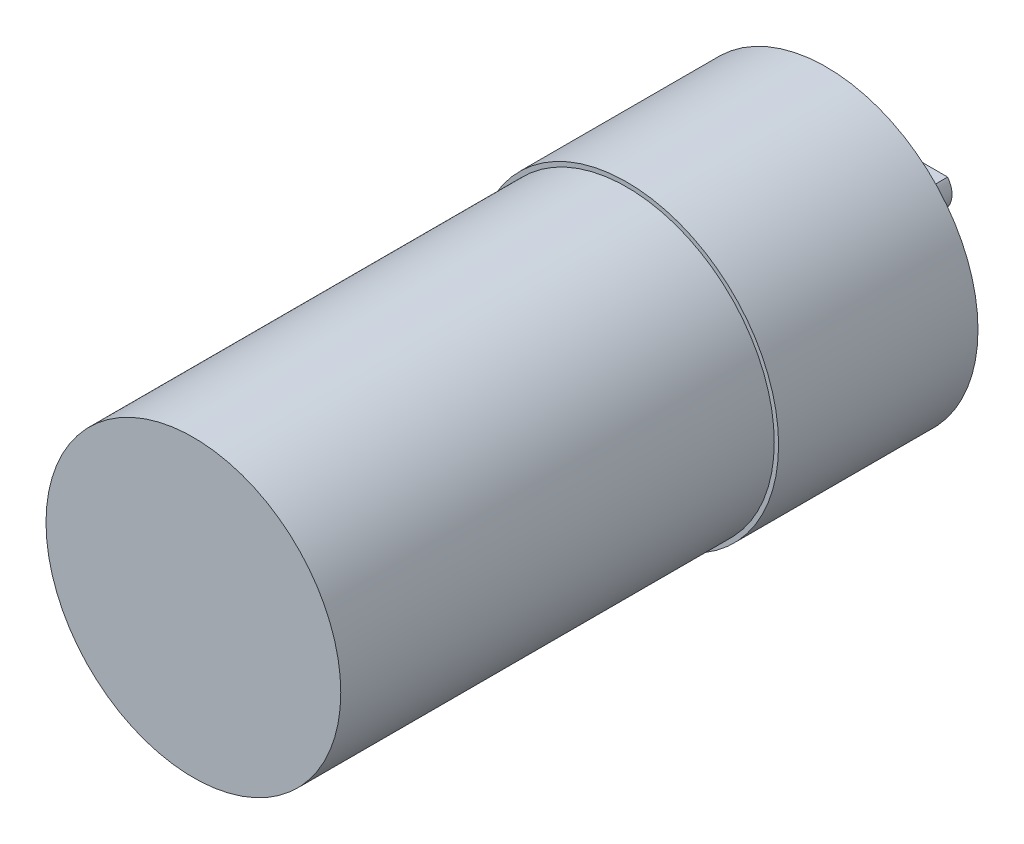
ISO-10303-21;
HEADER;
FILE_DESCRIPTION(('STEP AP214'),'2;1');
FILE_NAME('part.step','',(''),(''),'','','');
FILE_SCHEMA(('AUTOMOTIVE_DESIGN { 1 0 10303 214 1 1 1 1 }'));
ENDSEC;
DATA;
#1=APPLICATION_CONTEXT('core data for automotive mechanical design processes');
#2=APPLICATION_PROTOCOL_DEFINITION('international standard','automotive_design',2000,#1);
#3=PRODUCT_CONTEXT('',#1,'mechanical');
#4=PRODUCT('Part','Part','',(#3));
#5=PRODUCT_RELATED_PRODUCT_CATEGORY('part','',(#4));
#6=PRODUCT_DEFINITION_FORMATION('','',#4);
#7=PRODUCT_DEFINITION_CONTEXT('part definition',#1,'design');
#8=PRODUCT_DEFINITION('design','',#6,#7);
#9=PRODUCT_DEFINITION_SHAPE('','',#8);
#10=(LENGTH_UNIT() NAMED_UNIT(*) SI_UNIT(.MILLI.,.METRE.));
#11=(NAMED_UNIT(*) PLANE_ANGLE_UNIT() SI_UNIT($,.RADIAN.));
#12=(NAMED_UNIT(*) SI_UNIT($,.STERADIAN.) SOLID_ANGLE_UNIT());
#13=UNCERTAINTY_MEASURE_WITH_UNIT(LENGTH_MEASURE(1.E-05),#10,'distance_accuracy_value','');
#14=(GEOMETRIC_REPRESENTATION_CONTEXT(3) GLOBAL_UNCERTAINTY_ASSIGNED_CONTEXT((#13)) GLOBAL_UNIT_ASSIGNED_CONTEXT((#10,
#11,#12)) REPRESENTATION_CONTEXT('',''));
#15=CARTESIAN_POINT('',(0.,0.,0.));
#16=DIRECTION('',(0.,0.,1.));
#17=DIRECTION('',(1.,0.,0.));
#18=AXIS2_PLACEMENT_3D('',#15,#16,#17);
#19=CARTESIAN_POINT('',(0.,0.,-2.));
#20=DIRECTION('',(0.,0.,-1.));
#21=DIRECTION('',(-1.,0.,0.));
#22=AXIS2_PLACEMENT_3D('',#19,#20,#21);
#23=PLANE('',#22);
#24=CARTESIAN_POINT('',(0.,0.,-2.));
#25=DIRECTION('',(0.,0.,-1.));
#26=DIRECTION('',(-1.,0.,0.));
#27=AXIS2_PLACEMENT_3D('',#24,#25,#26);
#28=CIRCLE('',#27,5.);
#29=CARTESIAN_POINT('',(-5.,0.,-2.));
#30=VERTEX_POINT('',#29);
#31=EDGE_CURVE('E79',#30,#30,#28,.T.);
#32=ORIENTED_EDGE('',*,*,#31,.T.);
#33=EDGE_LOOP('',(#32));
#34=FACE_BOUND('',#33,.T.);
#35=DIRECTION('',(-1.,0.,0.));
#36=VECTOR('',#35,1.);
#37=CARTESIAN_POINT('',(0.,1.5,-2.));
#38=LINE('',#37,#36);
#39=CARTESIAN_POINT('',(2.,1.5,-2.));
#40=VERTEX_POINT('',#39);
#41=CARTESIAN_POINT('',(-2.,1.5,-2.));
#42=VERTEX_POINT('',#41);
#43=EDGE_CURVE('E49',#40,#42,#38,.T.);
#44=ORIENTED_EDGE('',*,*,#43,.T.);
#45=CARTESIAN_POINT('',(0.,0.,-2.));
#46=DIRECTION('',(0.,0.,-1.));
#47=DIRECTION('',(-1.,0.,0.));
#48=AXIS2_PLACEMENT_3D('',#45,#46,#47);
#49=CIRCLE('',#48,2.5);
#50=EDGE_CURVE('E70',#40,#42,#49,.T.);
#51=ORIENTED_EDGE('',*,*,#50,.F.);
#52=EDGE_LOOP('',(#44,#51));
#53=FACE_BOUND('',#52,.T.);
#54=ADVANCED_FACE('F34',(#34,#53),#23,.T.);
#55=CARTESIAN_POINT('',(0.,0.,23.));
#56=DIRECTION('',(0.,0.,-1.));
#57=DIRECTION('',(-1.,0.,0.));
#58=AXIS2_PLACEMENT_3D('',#55,#56,#57);
#59=CYLINDRICAL_SURFACE('',#58,17.5);
#60=CARTESIAN_POINT('',(0.,0.,23.));
#61=DIRECTION('',(0.,0.,1.));
#62=DIRECTION('',(1.,0.,0.));
#63=AXIS2_PLACEMENT_3D('',#60,#61,#62);
#64=CIRCLE('',#63,17.5);
#65=CARTESIAN_POINT('',(17.5,0.,23.));
#66=VERTEX_POINT('',#65);
#67=EDGE_CURVE('E42',#66,#66,#64,.T.);
#68=ORIENTED_EDGE('',*,*,#67,.F.);
#69=EDGE_LOOP('',(#68));
#70=FACE_BOUND('',#69,.T.);
#71=CARTESIAN_POINT('',(0.,0.,0.));
#72=DIRECTION('',(0.,0.,1.));
#73=DIRECTION('',(1.,0.,0.));
#74=AXIS2_PLACEMENT_3D('',#71,#72,#73);
#75=CIRCLE('',#74,17.5);
#76=CARTESIAN_POINT('',(17.5,0.,0.));
#77=VERTEX_POINT('',#76);
#78=EDGE_CURVE('E86',#77,#77,#75,.T.);
#79=ORIENTED_EDGE('',*,*,#78,.T.);
#80=EDGE_LOOP('',(#79));
#81=FACE_BOUND('',#80,.T.);
#82=ADVANCED_FACE('F36',(#70,#81),#59,.T.);
#83=CARTESIAN_POINT('',(0.,0.,23.));
#84=DIRECTION('',(0.,0.,1.));
#85=DIRECTION('',(1.,0.,0.));
#86=AXIS2_PLACEMENT_3D('',#83,#84,#85);
#87=PLANE('',#86);
#88=CARTESIAN_POINT('',(0.,0.,23.));
#89=DIRECTION('',(0.,0.,1.));
#90=DIRECTION('',(1.,0.,0.));
#91=AXIS2_PLACEMENT_3D('',#88,#89,#90);
#92=CIRCLE('',#91,17.);
#93=CARTESIAN_POINT('',(17.,0.,23.));
#94=VERTEX_POINT('',#93);
#95=EDGE_CURVE('E82',#94,#94,#92,.T.);
#96=ORIENTED_EDGE('',*,*,#95,.F.);
#97=EDGE_LOOP('',(#96));
#98=FACE_BOUND('',#97,.T.);
#99=ORIENTED_EDGE('',*,*,#67,.T.);
#100=EDGE_LOOP('',(#99));
#101=FACE_BOUND('',#100,.T.);
#102=ADVANCED_FACE('F97',(#98,#101),#87,.T.);
#103=CARTESIAN_POINT('',(0.,0.,0.));
#104=DIRECTION('',(0.,0.,1.));
#105=DIRECTION('',(1.,0.,0.));
#106=AXIS2_PLACEMENT_3D('',#103,#104,#105);
#107=PLANE('',#106);
#108=CARTESIAN_POINT('',(0.,0.,0.));
#109=DIRECTION('',(0.,0.,1.));
#110=DIRECTION('',(1.,0.,0.));
#111=AXIS2_PLACEMENT_3D('',#108,#109,#110);
#112=CIRCLE('',#111,5.);
#113=CARTESIAN_POINT('',(5.,0.,0.));
#114=VERTEX_POINT('',#113);
#115=EDGE_CURVE('E11',#114,#114,#112,.F.);
#116=ORIENTED_EDGE('',*,*,#115,.F.);
#117=EDGE_LOOP('',(#116));
#118=FACE_BOUND('',#117,.T.);
#119=ORIENTED_EDGE('',*,*,#78,.F.);
#120=EDGE_LOOP('',(#119));
#121=FACE_BOUND('',#120,.T.);
#122=ADVANCED_FACE('F94',(#118,#121),#107,.F.);
#123=CARTESIAN_POINT('',(0.,0.,73.));
#124=DIRECTION('',(0.,0.,-1.));
#125=DIRECTION('',(-1.,0.,0.));
#126=AXIS2_PLACEMENT_3D('',#123,#124,#125);
#127=CYLINDRICAL_SURFACE('',#126,17.);
#128=CARTESIAN_POINT('',(0.,0.,73.));
#129=DIRECTION('',(0.,0.,1.));
#130=DIRECTION('',(1.,0.,0.));
#131=AXIS2_PLACEMENT_3D('',#128,#129,#130);
#132=CIRCLE('',#131,17.);
#133=CARTESIAN_POINT('',(17.,0.,73.));
#134=VERTEX_POINT('',#133);
#135=EDGE_CURVE('E83',#134,#134,#132,.T.);
#136=ORIENTED_EDGE('',*,*,#135,.F.);
#137=EDGE_LOOP('',(#136));
#138=FACE_BOUND('',#137,.T.);
#139=ORIENTED_EDGE('',*,*,#95,.T.);
#140=EDGE_LOOP('',(#139));
#141=FACE_BOUND('',#140,.T.);
#142=ADVANCED_FACE('F96',(#138,#141),#127,.T.);
#143=CARTESIAN_POINT('',(0.,0.,73.));
#144=DIRECTION('',(0.,0.,1.));
#145=DIRECTION('',(1.,0.,0.));
#146=AXIS2_PLACEMENT_3D('',#143,#144,#145);
#147=PLANE('',#146);
#148=ORIENTED_EDGE('',*,*,#135,.T.);
#149=EDGE_LOOP('',(#148));
#150=FACE_BOUND('',#149,.T.);
#151=ADVANCED_FACE('F103',(#150),#147,.T.);
#152=CARTESIAN_POINT('',(0.,0.,-2.));
#153=DIRECTION('',(0.,0.,1.));
#154=DIRECTION('',(1.,0.,0.));
#155=AXIS2_PLACEMENT_3D('',#152,#153,#154);
#156=CYLINDRICAL_SURFACE('',#155,5.);
#157=ORIENTED_EDGE('',*,*,#31,.F.);
#158=EDGE_LOOP('',(#157));
#159=FACE_BOUND('',#158,.T.);
#160=ORIENTED_EDGE('',*,*,#115,.T.);
#161=EDGE_LOOP('',(#160));
#162=FACE_BOUND('',#161,.T.);
#163=ADVANCED_FACE('F119',(#159,#162),#156,.T.);
#164=CARTESIAN_POINT('',(0.,1.5,-12.));
#165=DIRECTION('',(0.,1.,0.));
#166=DIRECTION('',(0.,0.,1.));
#167=AXIS2_PLACEMENT_3D('',#164,#165,#166);
#168=PLANE('',#167);
#169=ORIENTED_EDGE('',*,*,#43,.F.);
#170=DIRECTION('',(0.,0.,1.));
#171=VECTOR('',#170,1.);
#172=CARTESIAN_POINT('',(2.,1.5,-12.));
#173=LINE('',#172,#171);
#174=CARTESIAN_POINT('',(2.,1.5,-12.));
#175=VERTEX_POINT('',#174);
#176=EDGE_CURVE('E67',#175,#40,#173,.T.);
#177=ORIENTED_EDGE('',*,*,#176,.F.);
#178=DIRECTION('',(-1.,0.,0.));
#179=VECTOR('',#178,1.);
#180=CARTESIAN_POINT('',(0.,1.5,-12.));
#181=LINE('',#180,#179);
#182=CARTESIAN_POINT('',(-2.,1.5,-12.));
#183=VERTEX_POINT('',#182);
#184=EDGE_CURVE('E65',#175,#183,#181,.T.);
#185=ORIENTED_EDGE('',*,*,#184,.T.);
#186=DIRECTION('',(0.,0.,1.));
#187=VECTOR('',#186,1.);
#188=CARTESIAN_POINT('',(-2.,1.5,-12.));
#189=LINE('',#188,#187);
#190=EDGE_CURVE('E62',#183,#42,#189,.T.);
#191=ORIENTED_EDGE('',*,*,#190,.T.);
#192=EDGE_LOOP('',(#169,#177,#185,#191));
#193=FACE_BOUND('',#192,.T.);
#194=ADVANCED_FACE('F64',(#193),#168,.T.);
#195=CARTESIAN_POINT('',(0.,0.,-12.));
#196=DIRECTION('',(0.,0.,1.));
#197=DIRECTION('',(1.,0.,0.));
#198=AXIS2_PLACEMENT_3D('',#195,#196,#197);
#199=CYLINDRICAL_SURFACE('',#198,2.5);
#200=ORIENTED_EDGE('',*,*,#50,.T.);
#201=ORIENTED_EDGE('',*,*,#190,.F.);
#202=CARTESIAN_POINT('',(0.,0.,-12.));
#203=DIRECTION('',(0.,0.,-1.));
#204=DIRECTION('',(-1.,0.,0.));
#205=AXIS2_PLACEMENT_3D('',#202,#203,#204);
#206=CIRCLE('',#205,2.5);
#207=EDGE_CURVE('E57',#175,#183,#206,.T.);
#208=ORIENTED_EDGE('',*,*,#207,.F.);
#209=ORIENTED_EDGE('',*,*,#176,.T.);
#210=EDGE_LOOP('',(#200,#201,#208,#209));
#211=FACE_BOUND('',#210,.T.);
#212=ADVANCED_FACE('F71',(#211),#199,.T.);
#213=CARTESIAN_POINT('',(0.,0.,-12.));
#214=DIRECTION('',(0.,0.,-1.));
#215=DIRECTION('',(-1.,0.,0.));
#216=AXIS2_PLACEMENT_3D('',#213,#214,#215);
#217=PLANE('',#216);
#218=ORIENTED_EDGE('',*,*,#184,.F.);
#219=ORIENTED_EDGE('',*,*,#207,.T.);
#220=EDGE_LOOP('',(#218,#219));
#221=FACE_BOUND('',#220,.T.);
#222=ADVANCED_FACE('F149',(#221),#217,.T.);
#223=CLOSED_SHELL('',(#54,#82,#102,#122,#142,#151,#163,#194,#212,#222));
#224=MANIFOLD_SOLID_BREP('B2',#223);
#225=ADVANCED_BREP_SHAPE_REPRESENTATION('',(#18,#224),#14);
#226=SHAPE_DEFINITION_REPRESENTATION(#9,#225);
ENDSEC;
END-ISO-10303-21;
